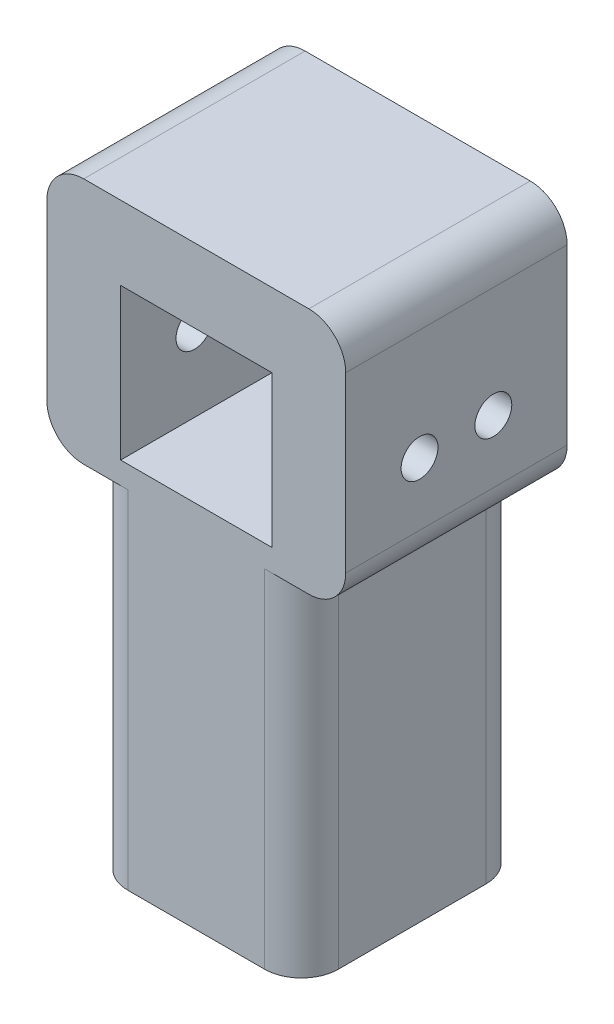
ISO-10303-21;
HEADER;
FILE_DESCRIPTION(('STEP AP214'),'2;1');
FILE_NAME('part.step','',(''),(''),'','','');
FILE_SCHEMA(('AUTOMOTIVE_DESIGN { 1 0 10303 214 1 1 1 1 }'));
ENDSEC;
DATA;
#1=APPLICATION_CONTEXT('core data for automotive mechanical design processes');
#2=APPLICATION_PROTOCOL_DEFINITION('international standard','automotive_design',2000,#1);
#3=PRODUCT_CONTEXT('',#1,'mechanical');
#4=PRODUCT('Part','Part','',(#3));
#5=PRODUCT_RELATED_PRODUCT_CATEGORY('part','',(#4));
#6=PRODUCT_DEFINITION_FORMATION('','',#4);
#7=PRODUCT_DEFINITION_CONTEXT('part definition',#1,'design');
#8=PRODUCT_DEFINITION('design','',#6,#7);
#9=PRODUCT_DEFINITION_SHAPE('','',#8);
#10=(LENGTH_UNIT() NAMED_UNIT(*) SI_UNIT(.MILLI.,.METRE.));
#11=(NAMED_UNIT(*) PLANE_ANGLE_UNIT() SI_UNIT($,.RADIAN.));
#12=(NAMED_UNIT(*) SI_UNIT($,.STERADIAN.) SOLID_ANGLE_UNIT());
#13=UNCERTAINTY_MEASURE_WITH_UNIT(LENGTH_MEASURE(1.E-05),#10,'distance_accuracy_value','');
#14=(GEOMETRIC_REPRESENTATION_CONTEXT(3) GLOBAL_UNCERTAINTY_ASSIGNED_CONTEXT((#13)) GLOBAL_UNIT_ASSIGNED_CONTEXT((#10,
#11,#12)) REPRESENTATION_CONTEXT('',''));
#15=CARTESIAN_POINT('',(0.,0.,0.));
#16=DIRECTION('',(0.,0.,1.));
#17=DIRECTION('',(1.,0.,0.));
#18=AXIS2_PLACEMENT_3D('',#15,#16,#17);
#19=CARTESIAN_POINT('',(20.5,0.,30.));
#20=DIRECTION('',(-1.,0.,0.));
#21=DIRECTION('',(0.,0.,1.));
#22=AXIS2_PLACEMENT_3D('',#19,#20,#21);
#23=PLANE('',#22);
#24=CARTESIAN_POINT('',(20.5,10.5,10.));
#25=DIRECTION('',(-1.,0.,0.));
#26=DIRECTION('',(0.,0.,1.));
#27=AXIS2_PLACEMENT_3D('',#24,#25,#26);
#28=CIRCLE('',#27,2.5);
#29=CARTESIAN_POINT('',(20.5,10.5,12.5));
#30=VERTEX_POINT('',#29);
#31=EDGE_CURVE('E423',#30,#30,#28,.T.);
#32=ORIENTED_EDGE('',*,*,#31,.F.);
#33=EDGE_LOOP('',(#32));
#34=FACE_BOUND('',#33,.T.);
#35=CARTESIAN_POINT('',(20.5,10.5,20.));
#36=DIRECTION('',(-1.,0.,0.));
#37=DIRECTION('',(0.,0.,1.));
#38=AXIS2_PLACEMENT_3D('',#35,#36,#37);
#39=CIRCLE('',#38,2.5);
#40=CARTESIAN_POINT('',(20.5,10.5,22.5));
#41=VERTEX_POINT('',#40);
#42=EDGE_CURVE('E222',#41,#41,#39,.T.);
#43=ORIENTED_EDGE('',*,*,#42,.F.);
#44=EDGE_LOOP('',(#43));
#45=FACE_BOUND('',#44,.T.);
#46=DIRECTION('',(0.,1.,0.));
#47=VECTOR('',#46,1.);
#48=CARTESIAN_POINT('',(20.5,0.,0.));
#49=LINE('',#48,#47);
#50=CARTESIAN_POINT('',(20.5,0.,0.));
#51=VERTEX_POINT('',#50);
#52=CARTESIAN_POINT('',(20.5,20.5,0.));
#53=VERTEX_POINT('',#52);
#54=EDGE_CURVE('E187',#51,#53,#49,.T.);
#55=ORIENTED_EDGE('',*,*,#54,.F.);
#56=DIRECTION('',(0.,0.,-1.));
#57=VECTOR('',#56,1.);
#58=CARTESIAN_POINT('',(20.5,0.,30.));
#59=LINE('',#58,#57);
#60=CARTESIAN_POINT('',(20.5,0.,30.));
#61=VERTEX_POINT('',#60);
#62=EDGE_CURVE('E183',#61,#51,#59,.T.);
#63=ORIENTED_EDGE('',*,*,#62,.F.);
#64=DIRECTION('',(0.,1.,0.));
#65=VECTOR('',#64,1.);
#66=CARTESIAN_POINT('',(20.5,0.,30.));
#67=LINE('',#66,#65);
#68=CARTESIAN_POINT('',(20.5,20.5,30.));
#69=VERTEX_POINT('',#68);
#70=EDGE_CURVE('E185',#61,#69,#67,.T.);
#71=ORIENTED_EDGE('',*,*,#70,.T.);
#72=DIRECTION('',(0.,0.,-1.));
#73=VECTOR('',#72,1.);
#74=CARTESIAN_POINT('',(20.5,20.5,30.));
#75=LINE('',#74,#73);
#76=EDGE_CURVE('E255',#69,#53,#75,.T.);
#77=ORIENTED_EDGE('',*,*,#76,.T.);
#78=EDGE_LOOP('',(#55,#63,#71,#77));
#79=FACE_BOUND('',#78,.T.);
#80=ADVANCED_FACE('F43',(#34,#45,#79),#23,.T.);
#81=CARTESIAN_POINT('',(0.,0.,30.));
#82=DIRECTION('',(0.,1.,0.));
#83=DIRECTION('',(0.,0.,1.));
#84=AXIS2_PLACEMENT_3D('',#81,#82,#83);
#85=PLANE('',#84);
#86=DIRECTION('',(1.,0.,0.));
#87=VECTOR('',#86,1.);
#88=CARTESIAN_POINT('',(0.,0.,0.));
#89=LINE('',#88,#87);
#90=CARTESIAN_POINT('',(0.,0.,0.));
#91=VERTEX_POINT('',#90);
#92=EDGE_CURVE('E243',#91,#51,#89,.T.);
#93=ORIENTED_EDGE('',*,*,#92,.F.);
#94=DIRECTION('',(0.,0.,-1.));
#95=VECTOR('',#94,1.);
#96=CARTESIAN_POINT('',(0.,0.,30.));
#97=LINE('',#96,#95);
#98=CARTESIAN_POINT('',(0.,0.,30.));
#99=VERTEX_POINT('',#98);
#100=EDGE_CURVE('E194',#99,#91,#97,.T.);
#101=ORIENTED_EDGE('',*,*,#100,.F.);
#102=DIRECTION('',(1.,0.,0.));
#103=VECTOR('',#102,1.);
#104=CARTESIAN_POINT('',(0.,0.,30.));
#105=LINE('',#104,#103);
#106=EDGE_CURVE('E200',#99,#61,#105,.T.);
#107=ORIENTED_EDGE('',*,*,#106,.T.);
#108=ORIENTED_EDGE('',*,*,#62,.T.);
#109=EDGE_LOOP('',(#93,#101,#107,#108));
#110=FACE_BOUND('',#109,.T.);
#111=ADVANCED_FACE('F206',(#110),#85,.T.);
#112=CARTESIAN_POINT('',(0.,0.,30.));
#113=DIRECTION('',(-1.,0.,0.));
#114=DIRECTION('',(0.,0.,1.));
#115=AXIS2_PLACEMENT_3D('',#112,#113,#114);
#116=PLANE('',#115);
#117=CARTESIAN_POINT('',(0.,10.5,10.));
#118=DIRECTION('',(-1.,0.,0.));
#119=DIRECTION('',(0.,0.,1.));
#120=AXIS2_PLACEMENT_3D('',#117,#118,#119);
#121=CIRCLE('',#120,2.5);
#122=CARTESIAN_POINT('',(0.,10.5,12.5));
#123=VERTEX_POINT('',#122);
#124=EDGE_CURVE('E430',#123,#123,#121,.T.);
#125=ORIENTED_EDGE('',*,*,#124,.T.);
#126=EDGE_LOOP('',(#125));
#127=FACE_BOUND('',#126,.T.);
#128=CARTESIAN_POINT('',(0.,10.5,20.));
#129=DIRECTION('',(-1.,0.,0.));
#130=DIRECTION('',(0.,0.,1.));
#131=AXIS2_PLACEMENT_3D('',#128,#129,#130);
#132=CIRCLE('',#131,2.5);
#133=CARTESIAN_POINT('',(0.,10.5,22.5));
#134=VERTEX_POINT('',#133);
#135=EDGE_CURVE('E414',#134,#134,#132,.T.);
#136=ORIENTED_EDGE('',*,*,#135,.T.);
#137=EDGE_LOOP('',(#136));
#138=FACE_BOUND('',#137,.T.);
#139=DIRECTION('',(0.,1.,0.));
#140=VECTOR('',#139,1.);
#141=CARTESIAN_POINT('',(0.,0.,0.));
#142=LINE('',#141,#140);
#143=CARTESIAN_POINT('',(0.,20.5,0.));
#144=VERTEX_POINT('',#143);
#145=EDGE_CURVE('E246',#91,#144,#142,.T.);
#146=ORIENTED_EDGE('',*,*,#145,.T.);
#147=DIRECTION('',(0.,0.,-1.));
#148=VECTOR('',#147,1.);
#149=CARTESIAN_POINT('',(0.,20.5,30.));
#150=LINE('',#149,#148);
#151=CARTESIAN_POINT('',(0.,20.5,30.));
#152=VERTEX_POINT('',#151);
#153=EDGE_CURVE('E258',#152,#144,#150,.T.);
#154=ORIENTED_EDGE('',*,*,#153,.F.);
#155=DIRECTION('',(0.,1.,0.));
#156=VECTOR('',#155,1.);
#157=CARTESIAN_POINT('',(0.,0.,30.));
#158=LINE('',#157,#156);
#159=EDGE_CURVE('E209',#99,#152,#158,.T.);
#160=ORIENTED_EDGE('',*,*,#159,.F.);
#161=ORIENTED_EDGE('',*,*,#100,.T.);
#162=EDGE_LOOP('',(#146,#154,#160,#161));
#163=FACE_BOUND('',#162,.T.);
#164=ADVANCED_FACE('F452',(#127,#138,#163),#116,.F.);
#165=CARTESIAN_POINT('',(24.5,0.,30.));
#166=DIRECTION('',(-1.,0.,0.));
#167=DIRECTION('',(0.,0.,1.));
#168=AXIS2_PLACEMENT_3D('',#165,#166,#167);
#169=PLANE('',#168);
#170=DIRECTION('',(0.,0.,-1.));
#171=VECTOR('',#170,1.);
#172=CARTESIAN_POINT('',(24.5,-3.,30.));
#173=LINE('',#172,#171);
#174=CARTESIAN_POINT('',(24.5,-3.,25.));
#175=VERTEX_POINT('',#174);
#176=CARTESIAN_POINT('',(24.5,-3.,5.));
#177=VERTEX_POINT('',#176);
#178=EDGE_CURVE('E259',#175,#177,#173,.T.);
#179=ORIENTED_EDGE('',*,*,#178,.F.);
#180=DIRECTION('',(0.,1.,0.));
#181=VECTOR('',#180,1.);
#182=CARTESIAN_POINT('',(24.5,-50.,25.));
#183=LINE('',#182,#181);
#184=CARTESIAN_POINT('',(24.5,-50.,25.));
#185=VERTEX_POINT('',#184);
#186=EDGE_CURVE('E308',#175,#185,#183,.F.);
#187=ORIENTED_EDGE('',*,*,#186,.T.);
#188=DIRECTION('',(0.,0.,-1.));
#189=VECTOR('',#188,1.);
#190=CARTESIAN_POINT('',(24.5,-50.,30.));
#191=LINE('',#190,#189);
#192=CARTESIAN_POINT('',(24.5,-50.,5.));
#193=VERTEX_POINT('',#192);
#194=EDGE_CURVE('E217',#185,#193,#191,.T.);
#195=ORIENTED_EDGE('',*,*,#194,.T.);
#196=DIRECTION('',(0.,1.,0.));
#197=VECTOR('',#196,1.);
#198=CARTESIAN_POINT('',(24.5,0.,5.));
#199=LINE('',#198,#197);
#200=EDGE_CURVE('E304',#193,#177,#199,.T.);
#201=ORIENTED_EDGE('',*,*,#200,.T.);
#202=EDGE_LOOP('',(#179,#187,#195,#201));
#203=FACE_BOUND('',#202,.T.);
#204=ADVANCED_FACE('F455',(#203),#169,.F.);
#205=CARTESIAN_POINT('',(0.,-3.,30.));
#206=DIRECTION('',(0.,-1.,0.));
#207=DIRECTION('',(1.,0.,0.));
#208=AXIS2_PLACEMENT_3D('',#205,#206,#207);
#209=PLANE('',#208);
#210=DIRECTION('',(-1.,0.,0.));
#211=VECTOR('',#210,1.);
#212=CARTESIAN_POINT('',(0.,-3.,0.));
#213=LINE('',#212,#211);
#214=CARTESIAN_POINT('',(25.5,-3.,0.));
#215=VERTEX_POINT('',#214);
#216=CARTESIAN_POINT('',(19.5,-3.,0.));
#217=VERTEX_POINT('',#216);
#218=EDGE_CURVE('E218',#215,#217,#213,.T.);
#219=ORIENTED_EDGE('',*,*,#218,.F.);
#220=DIRECTION('',(0.,0.,-1.));
#221=VECTOR('',#220,1.);
#222=CARTESIAN_POINT('',(25.5,-3.,30.));
#223=LINE('',#222,#221);
#224=CARTESIAN_POINT('',(25.5,-3.,30.));
#225=VERTEX_POINT('',#224);
#226=EDGE_CURVE('E351',#215,#225,#223,.F.);
#227=ORIENTED_EDGE('',*,*,#226,.T.);
#228=DIRECTION('',(-1.,0.,0.));
#229=VECTOR('',#228,1.);
#230=CARTESIAN_POINT('',(0.,-3.,30.));
#231=LINE('',#230,#229);
#232=CARTESIAN_POINT('',(19.5,-3.,30.));
#233=VERTEX_POINT('',#232);
#234=EDGE_CURVE('E254',#225,#233,#231,.T.);
#235=ORIENTED_EDGE('',*,*,#234,.T.);
#236=CARTESIAN_POINT('',(19.5,-3.,25.));
#237=DIRECTION('',(0.,-1.,0.));
#238=DIRECTION('',(1.,0.,0.));
#239=AXIS2_PLACEMENT_3D('',#236,#237,#238);
#240=CIRCLE('',#239,5.);
#241=EDGE_CURVE('E322',#233,#175,#240,.F.);
#242=ORIENTED_EDGE('',*,*,#241,.T.);
#243=ORIENTED_EDGE('',*,*,#178,.T.);
#244=CARTESIAN_POINT('',(19.5,-3.,5.));
#245=DIRECTION('',(0.,-1.,0.));
#246=DIRECTION('',(1.,0.,0.));
#247=AXIS2_PLACEMENT_3D('',#244,#245,#246);
#248=CIRCLE('',#247,5.);
#249=EDGE_CURVE('E328',#177,#217,#248,.F.);
#250=ORIENTED_EDGE('',*,*,#249,.T.);
#251=EDGE_LOOP('',(#219,#227,#235,#242,#243,#250));
#252=FACE_BOUND('',#251,.T.);
#253=ADVANCED_FACE('F499',(#252),#209,.T.);
#254=CARTESIAN_POINT('',(30.5,0.,30.));
#255=DIRECTION('',(1.,0.,0.));
#256=DIRECTION('',(0.,0.,-1.));
#257=AXIS2_PLACEMENT_3D('',#254,#255,#256);
#258=PLANE('',#257);
#259=CARTESIAN_POINT('',(30.5,10.5,10.));
#260=DIRECTION('',(1.,0.,0.));
#261=DIRECTION('',(0.,0.,-1.));
#262=AXIS2_PLACEMENT_3D('',#259,#260,#261);
#263=CIRCLE('',#262,2.5);
#264=CARTESIAN_POINT('',(30.5,10.5,7.5));
#265=VERTEX_POINT('',#264);
#266=EDGE_CURVE('E435',#265,#265,#263,.T.);
#267=ORIENTED_EDGE('',*,*,#266,.F.);
#268=EDGE_LOOP('',(#267));
#269=FACE_BOUND('',#268,.T.);
#270=CARTESIAN_POINT('',(30.5,10.5,20.));
#271=DIRECTION('',(1.,0.,0.));
#272=DIRECTION('',(0.,0.,-1.));
#273=AXIS2_PLACEMENT_3D('',#270,#271,#272);
#274=CIRCLE('',#273,2.5);
#275=CARTESIAN_POINT('',(30.5,10.5,17.5));
#276=VERTEX_POINT('',#275);
#277=EDGE_CURVE('E419',#276,#276,#274,.T.);
#278=ORIENTED_EDGE('',*,*,#277,.F.);
#279=EDGE_LOOP('',(#278));
#280=FACE_BOUND('',#279,.T.);
#281=DIRECTION('',(0.,-1.,0.));
#282=VECTOR('',#281,1.);
#283=CARTESIAN_POINT('',(30.5,0.,30.));
#284=LINE('',#283,#282);
#285=CARTESIAN_POINT('',(30.5,25.5,30.));
#286=VERTEX_POINT('',#285);
#287=CARTESIAN_POINT('',(30.5,2.,30.));
#288=VERTEX_POINT('',#287);
#289=EDGE_CURVE('E405',#286,#288,#284,.T.);
#290=ORIENTED_EDGE('',*,*,#289,.T.);
#291=DIRECTION('',(0.,0.,-1.));
#292=VECTOR('',#291,1.);
#293=CARTESIAN_POINT('',(30.5,2.,30.));
#294=LINE('',#293,#292);
#295=CARTESIAN_POINT('',(30.5,2.,0.));
#296=VERTEX_POINT('',#295);
#297=EDGE_CURVE('E335',#288,#296,#294,.T.);
#298=ORIENTED_EDGE('',*,*,#297,.T.);
#299=DIRECTION('',(0.,-1.,0.));
#300=VECTOR('',#299,1.);
#301=CARTESIAN_POINT('',(30.5,0.,0.));
#302=LINE('',#301,#300);
#303=CARTESIAN_POINT('',(30.5,25.5,0.));
#304=VERTEX_POINT('',#303);
#305=EDGE_CURVE('E221',#304,#296,#302,.T.);
#306=ORIENTED_EDGE('',*,*,#305,.F.);
#307=DIRECTION('',(0.,0.,-1.));
#308=VECTOR('',#307,1.);
#309=CARTESIAN_POINT('',(30.5,25.5,30.));
#310=LINE('',#309,#308);
#311=EDGE_CURVE('E332',#304,#286,#310,.F.);
#312=ORIENTED_EDGE('',*,*,#311,.T.);
#313=EDGE_LOOP('',(#290,#298,#306,#312));
#314=FACE_BOUND('',#313,.T.);
#315=ADVANCED_FACE('F495',(#269,#280,#314),#258,.T.);
#316=CARTESIAN_POINT('',(0.,30.5,30.));
#317=DIRECTION('',(0.,1.,0.));
#318=DIRECTION('',(0.,0.,1.));
#319=AXIS2_PLACEMENT_3D('',#316,#317,#318);
#320=PLANE('',#319);
#321=DIRECTION('',(1.,0.,0.));
#322=VECTOR('',#321,1.);
#323=CARTESIAN_POINT('',(0.,30.5,30.));
#324=LINE('',#323,#322);
#325=CARTESIAN_POINT('',(-5.,30.5,30.));
#326=VERTEX_POINT('',#325);
#327=CARTESIAN_POINT('',(25.5,30.5,30.));
#328=VERTEX_POINT('',#327);
#329=EDGE_CURVE('E399',#326,#328,#324,.T.);
#330=ORIENTED_EDGE('',*,*,#329,.T.);
#331=DIRECTION('',(0.,0.,-1.));
#332=VECTOR('',#331,1.);
#333=CARTESIAN_POINT('',(25.5,30.5,30.));
#334=LINE('',#333,#332);
#335=CARTESIAN_POINT('',(25.5,30.5,0.));
#336=VERTEX_POINT('',#335);
#337=EDGE_CURVE('E368',#328,#336,#334,.T.);
#338=ORIENTED_EDGE('',*,*,#337,.T.);
#339=DIRECTION('',(1.,0.,0.));
#340=VECTOR('',#339,1.);
#341=CARTESIAN_POINT('',(0.,30.5,0.));
#342=LINE('',#341,#340);
#343=CARTESIAN_POINT('',(-5.,30.5,0.));
#344=VERTEX_POINT('',#343);
#345=EDGE_CURVE('E226',#344,#336,#342,.T.);
#346=ORIENTED_EDGE('',*,*,#345,.F.);
#347=DIRECTION('',(0.,0.,-1.));
#348=VECTOR('',#347,1.);
#349=CARTESIAN_POINT('',(-5.,30.5,30.));
#350=LINE('',#349,#348);
#351=EDGE_CURVE('E365',#344,#326,#350,.F.);
#352=ORIENTED_EDGE('',*,*,#351,.T.);
#353=EDGE_LOOP('',(#330,#338,#346,#352));
#354=FACE_BOUND('',#353,.T.);
#355=ADVANCED_FACE('F492',(#354),#320,.T.);
#356=CARTESIAN_POINT('',(-10.,0.,30.));
#357=DIRECTION('',(-1.,0.,0.));
#358=DIRECTION('',(0.,0.,1.));
#359=AXIS2_PLACEMENT_3D('',#356,#357,#358);
#360=PLANE('',#359);
#361=DIRECTION('',(0.,1.,0.));
#362=VECTOR('',#361,1.);
#363=CARTESIAN_POINT('',(-10.,0.,30.));
#364=LINE('',#363,#362);
#365=CARTESIAN_POINT('',(-10.,2.,30.));
#366=VERTEX_POINT('',#365);
#367=CARTESIAN_POINT('',(-10.,25.5,30.));
#368=VERTEX_POINT('',#367);
#369=EDGE_CURVE('E377',#366,#368,#364,.T.);
#370=ORIENTED_EDGE('',*,*,#369,.T.);
#371=DIRECTION('',(0.,0.,-1.));
#372=VECTOR('',#371,1.);
#373=CARTESIAN_POINT('',(-10.,25.5,30.));
#374=LINE('',#373,#372);
#375=CARTESIAN_POINT('',(-10.,25.5,0.));
#376=VERTEX_POINT('',#375);
#377=EDGE_CURVE('E52',#368,#376,#374,.T.);
#378=ORIENTED_EDGE('',*,*,#377,.T.);
#379=DIRECTION('',(0.,1.,0.));
#380=VECTOR('',#379,1.);
#381=CARTESIAN_POINT('',(-10.,0.,0.));
#382=LINE('',#381,#380);
#383=CARTESIAN_POINT('',(-10.,2.,0.));
#384=VERTEX_POINT('',#383);
#385=EDGE_CURVE('E230',#384,#376,#382,.T.);
#386=ORIENTED_EDGE('',*,*,#385,.F.);
#387=DIRECTION('',(0.,0.,-1.));
#388=VECTOR('',#387,1.);
#389=CARTESIAN_POINT('',(-10.,2.,30.));
#390=LINE('',#389,#388);
#391=EDGE_CURVE('E66',#384,#366,#390,.F.);
#392=ORIENTED_EDGE('',*,*,#391,.T.);
#393=EDGE_LOOP('',(#370,#378,#386,#392));
#394=FACE_BOUND('',#393,.T.);
#395=ADVANCED_FACE('F376',(#394),#360,.T.);
#396=CARTESIAN_POINT('',(0.,-3.,30.));
#397=DIRECTION('',(0.,1.,0.));
#398=DIRECTION('',(0.,0.,1.));
#399=AXIS2_PLACEMENT_3D('',#396,#397,#398);
#400=PLANE('',#399);
#401=DIRECTION('',(1.,0.,0.));
#402=VECTOR('',#401,1.);
#403=CARTESIAN_POINT('',(0.,-3.,30.));
#404=LINE('',#403,#402);
#405=CARTESIAN_POINT('',(-5.,-3.,30.));
#406=VERTEX_POINT('',#405);
#407=CARTESIAN_POINT('',(1.,-3.,30.));
#408=VERTEX_POINT('',#407);
#409=EDGE_CURVE('E391',#406,#408,#404,.T.);
#410=ORIENTED_EDGE('',*,*,#409,.F.);
#411=DIRECTION('',(0.,0.,-1.));
#412=VECTOR('',#411,1.);
#413=CARTESIAN_POINT('',(-5.,-3.,0.));
#414=LINE('',#413,#412);
#415=CARTESIAN_POINT('',(-5.,-3.,0.));
#416=VERTEX_POINT('',#415);
#417=EDGE_CURVE('E11',#406,#416,#414,.T.);
#418=ORIENTED_EDGE('',*,*,#417,.T.);
#419=DIRECTION('',(1.,0.,0.));
#420=VECTOR('',#419,1.);
#421=CARTESIAN_POINT('',(0.,-3.,0.));
#422=LINE('',#421,#420);
#423=CARTESIAN_POINT('',(1.,-3.,0.));
#424=VERTEX_POINT('',#423);
#425=EDGE_CURVE('E234',#416,#424,#422,.T.);
#426=ORIENTED_EDGE('',*,*,#425,.T.);
#427=CARTESIAN_POINT('',(1.,-3.,5.));
#428=DIRECTION('',(0.,1.,0.));
#429=DIRECTION('',(0.,0.,1.));
#430=AXIS2_PLACEMENT_3D('',#427,#428,#429);
#431=CIRCLE('',#430,5.);
#432=CARTESIAN_POINT('',(-4.,-3.,5.));
#433=VERTEX_POINT('',#432);
#434=EDGE_CURVE('E325',#424,#433,#431,.T.);
#435=ORIENTED_EDGE('',*,*,#434,.T.);
#436=DIRECTION('',(0.,0.,-1.));
#437=VECTOR('',#436,1.);
#438=CARTESIAN_POINT('',(-4.,-3.,30.));
#439=LINE('',#438,#437);
#440=CARTESIAN_POINT('',(-4.,-3.,25.));
#441=VERTEX_POINT('',#440);
#442=EDGE_CURVE('E272',#441,#433,#439,.T.);
#443=ORIENTED_EDGE('',*,*,#442,.F.);
#444=CARTESIAN_POINT('',(1.,-3.,25.));
#445=DIRECTION('',(0.,1.,0.));
#446=DIRECTION('',(0.,0.,1.));
#447=AXIS2_PLACEMENT_3D('',#444,#445,#446);
#448=CIRCLE('',#447,5.);
#449=EDGE_CURVE('E318',#441,#408,#448,.T.);
#450=ORIENTED_EDGE('',*,*,#449,.T.);
#451=EDGE_LOOP('',(#410,#418,#426,#435,#443,#450));
#452=FACE_BOUND('',#451,.T.);
#453=ADVANCED_FACE('F389',(#452),#400,.F.);
#454=CARTESIAN_POINT('',(-4.,0.,30.));
#455=DIRECTION('',(-1.,0.,0.));
#456=DIRECTION('',(0.,0.,1.));
#457=AXIS2_PLACEMENT_3D('',#454,#455,#456);
#458=PLANE('',#457);
#459=DIRECTION('',(0.,0.,-1.));
#460=VECTOR('',#459,1.);
#461=CARTESIAN_POINT('',(-4.,-50.,30.));
#462=LINE('',#461,#460);
#463=CARTESIAN_POINT('',(-4.,-50.,25.));
#464=VERTEX_POINT('',#463);
#465=CARTESIAN_POINT('',(-4.,-50.,5.));
#466=VERTEX_POINT('',#465);
#467=EDGE_CURVE('E268',#464,#466,#462,.T.);
#468=ORIENTED_EDGE('',*,*,#467,.F.);
#469=DIRECTION('',(0.,1.,0.));
#470=VECTOR('',#469,1.);
#471=CARTESIAN_POINT('',(-4.,0.,25.));
#472=LINE('',#471,#470);
#473=EDGE_CURVE('E281',#464,#441,#472,.T.);
#474=ORIENTED_EDGE('',*,*,#473,.T.);
#475=ORIENTED_EDGE('',*,*,#442,.T.);
#476=DIRECTION('',(0.,1.,0.));
#477=VECTOR('',#476,1.);
#478=CARTESIAN_POINT('',(-4.,-50.,5.));
#479=LINE('',#478,#477);
#480=EDGE_CURVE('E193',#433,#466,#479,.F.);
#481=ORIENTED_EDGE('',*,*,#480,.T.);
#482=EDGE_LOOP('',(#468,#474,#475,#481));
#483=FACE_BOUND('',#482,.T.);
#484=ADVANCED_FACE('F471',(#483),#458,.T.);
#485=CARTESIAN_POINT('',(0.,-50.,30.));
#486=DIRECTION('',(0.,1.,0.));
#487=DIRECTION('',(0.,0.,1.));
#488=AXIS2_PLACEMENT_3D('',#485,#486,#487);
#489=PLANE('',#488);
#490=DIRECTION('',(1.,0.,0.));
#491=VECTOR('',#490,1.);
#492=CARTESIAN_POINT('',(0.,-50.,30.));
#493=LINE('',#492,#491);
#494=CARTESIAN_POINT('',(1.,-50.,30.));
#495=VERTEX_POINT('',#494);
#496=CARTESIAN_POINT('',(19.5,-50.,30.));
#497=VERTEX_POINT('',#496);
#498=EDGE_CURVE('E204',#495,#497,#493,.T.);
#499=ORIENTED_EDGE('',*,*,#498,.F.);
#500=CARTESIAN_POINT('',(1.,-50.,25.));
#501=DIRECTION('',(0.,1.,0.));
#502=DIRECTION('',(0.,0.,1.));
#503=AXIS2_PLACEMENT_3D('',#500,#501,#502);
#504=CIRCLE('',#503,5.);
#505=EDGE_CURVE('E301',#495,#464,#504,.F.);
#506=ORIENTED_EDGE('',*,*,#505,.T.);
#507=ORIENTED_EDGE('',*,*,#467,.T.);
#508=CARTESIAN_POINT('',(1.,-50.,5.));
#509=DIRECTION('',(0.,1.,0.));
#510=DIRECTION('',(0.,0.,1.));
#511=AXIS2_PLACEMENT_3D('',#508,#509,#510);
#512=CIRCLE('',#511,5.);
#513=CARTESIAN_POINT('',(1.,-50.,0.));
#514=VERTEX_POINT('',#513);
#515=EDGE_CURVE('E295',#466,#514,#512,.F.);
#516=ORIENTED_EDGE('',*,*,#515,.T.);
#517=DIRECTION('',(1.,0.,0.));
#518=VECTOR('',#517,1.);
#519=CARTESIAN_POINT('',(0.,-50.,0.));
#520=LINE('',#519,#518);
#521=CARTESIAN_POINT('',(19.5,-50.,0.));
#522=VERTEX_POINT('',#521);
#523=EDGE_CURVE('E237',#514,#522,#520,.T.);
#524=ORIENTED_EDGE('',*,*,#523,.T.);
#525=CARTESIAN_POINT('',(19.5,-50.,5.));
#526=DIRECTION('',(0.,1.,0.));
#527=DIRECTION('',(0.,0.,1.));
#528=AXIS2_PLACEMENT_3D('',#525,#526,#527);
#529=CIRCLE('',#528,5.);
#530=EDGE_CURVE('E292',#522,#193,#529,.F.);
#531=ORIENTED_EDGE('',*,*,#530,.T.);
#532=ORIENTED_EDGE('',*,*,#194,.F.);
#533=CARTESIAN_POINT('',(19.5,-50.,25.));
#534=DIRECTION('',(0.,1.,0.));
#535=DIRECTION('',(0.,0.,1.));
#536=AXIS2_PLACEMENT_3D('',#533,#534,#535);
#537=CIRCLE('',#536,5.);
#538=EDGE_CURVE('E298',#185,#497,#537,.F.);
#539=ORIENTED_EDGE('',*,*,#538,.T.);
#540=EDGE_LOOP('',(#499,#506,#507,#516,#524,#531,#532,#539));
#541=FACE_BOUND('',#540,.T.);
#542=ADVANCED_FACE('F464',(#541),#489,.F.);
#543=CARTESIAN_POINT('',(0.,20.5,30.));
#544=DIRECTION('',(0.,1.,0.));
#545=DIRECTION('',(0.,0.,1.));
#546=AXIS2_PLACEMENT_3D('',#543,#544,#545);
#547=PLANE('',#546);
#548=DIRECTION('',(1.,0.,0.));
#549=VECTOR('',#548,1.);
#550=CARTESIAN_POINT('',(0.,20.5,0.));
#551=LINE('',#550,#549);
#552=EDGE_CURVE('E250',#144,#53,#551,.T.);
#553=ORIENTED_EDGE('',*,*,#552,.T.);
#554=ORIENTED_EDGE('',*,*,#76,.F.);
#555=DIRECTION('',(1.,0.,0.));
#556=VECTOR('',#555,1.);
#557=CARTESIAN_POINT('',(0.,20.5,30.));
#558=LINE('',#557,#556);
#559=EDGE_CURVE('E201',#152,#69,#558,.T.);
#560=ORIENTED_EDGE('',*,*,#559,.F.);
#561=ORIENTED_EDGE('',*,*,#153,.T.);
#562=EDGE_LOOP('',(#553,#554,#560,#561));
#563=FACE_BOUND('',#562,.T.);
#564=ADVANCED_FACE('F462',(#563),#547,.F.);
#565=CARTESIAN_POINT('',(0.,0.,30.));
#566=DIRECTION('',(0.,0.,1.));
#567=DIRECTION('',(1.,0.,0.));
#568=AXIS2_PLACEMENT_3D('',#565,#566,#567);
#569=PLANE('',#568);
#570=ORIENTED_EDGE('',*,*,#234,.F.);
#571=CARTESIAN_POINT('',(25.5,2.,30.));
#572=DIRECTION('',(0.,0.,1.));
#573=DIRECTION('',(1.,0.,0.));
#574=AXIS2_PLACEMENT_3D('',#571,#572,#573);
#575=CIRCLE('',#574,5.);
#576=EDGE_CURVE('E362',#225,#288,#575,.T.);
#577=ORIENTED_EDGE('',*,*,#576,.T.);
#578=ORIENTED_EDGE('',*,*,#289,.F.);
#579=CARTESIAN_POINT('',(25.5,25.5,30.));
#580=DIRECTION('',(0.,0.,1.));
#581=DIRECTION('',(1.,0.,0.));
#582=AXIS2_PLACEMENT_3D('',#579,#580,#581);
#583=CIRCLE('',#582,5.);
#584=EDGE_CURVE('E359',#286,#328,#583,.T.);
#585=ORIENTED_EDGE('',*,*,#584,.T.);
#586=ORIENTED_EDGE('',*,*,#329,.F.);
#587=CARTESIAN_POINT('',(-5.,25.5,30.));
#588=DIRECTION('',(0.,0.,1.));
#589=DIRECTION('',(1.,0.,0.));
#590=AXIS2_PLACEMENT_3D('',#587,#588,#589);
#591=CIRCLE('',#590,5.);
#592=EDGE_CURVE('E59',#326,#368,#591,.T.);
#593=ORIENTED_EDGE('',*,*,#592,.T.);
#594=ORIENTED_EDGE('',*,*,#369,.F.);
#595=CARTESIAN_POINT('',(-5.,2.,30.));
#596=DIRECTION('',(0.,0.,1.));
#597=DIRECTION('',(1.,0.,0.));
#598=AXIS2_PLACEMENT_3D('',#595,#596,#597);
#599=CIRCLE('',#598,5.);
#600=EDGE_CURVE('E354',#366,#406,#599,.T.);
#601=ORIENTED_EDGE('',*,*,#600,.T.);
#602=ORIENTED_EDGE('',*,*,#409,.T.);
#603=DIRECTION('',(0.,1.,0.));
#604=VECTOR('',#603,1.);
#605=CARTESIAN_POINT('',(1.,0.,30.));
#606=LINE('',#605,#604);
#607=EDGE_CURVE('E289',#408,#495,#606,.F.);
#608=ORIENTED_EDGE('',*,*,#607,.T.);
#609=ORIENTED_EDGE('',*,*,#498,.T.);
#610=DIRECTION('',(0.,1.,0.));
#611=VECTOR('',#610,1.);
#612=CARTESIAN_POINT('',(19.5,-3.,30.));
#613=LINE('',#612,#611);
#614=EDGE_CURVE('E285',#497,#233,#613,.T.);
#615=ORIENTED_EDGE('',*,*,#614,.T.);
#616=EDGE_LOOP('',(#570,#577,#578,#585,#586,#593,#594,#601,#602,#608,#609,#615));
#617=FACE_BOUND('',#616,.T.);
#618=ORIENTED_EDGE('',*,*,#70,.F.);
#619=ORIENTED_EDGE('',*,*,#106,.F.);
#620=ORIENTED_EDGE('',*,*,#159,.T.);
#621=ORIENTED_EDGE('',*,*,#559,.T.);
#622=EDGE_LOOP('',(#618,#619,#620,#621));
#623=FACE_BOUND('',#622,.T.);
#624=ADVANCED_FACE('F198',(#617,#623),#569,.T.);
#625=CARTESIAN_POINT('',(0.,0.,0.));
#626=DIRECTION('',(0.,0.,1.));
#627=DIRECTION('',(1.,0.,0.));
#628=AXIS2_PLACEMENT_3D('',#625,#626,#627);
#629=PLANE('',#628);
#630=ORIENTED_EDGE('',*,*,#305,.T.);
#631=CARTESIAN_POINT('',(25.5,2.,0.));
#632=DIRECTION('',(0.,0.,1.));
#633=DIRECTION('',(1.,0.,0.));
#634=AXIS2_PLACEMENT_3D('',#631,#632,#633);
#635=CIRCLE('',#634,5.);
#636=EDGE_CURVE('E348',#296,#215,#635,.F.);
#637=ORIENTED_EDGE('',*,*,#636,.T.);
#638=ORIENTED_EDGE('',*,*,#218,.T.);
#639=DIRECTION('',(0.,1.,0.));
#640=VECTOR('',#639,1.);
#641=CARTESIAN_POINT('',(19.5,0.,0.));
#642=LINE('',#641,#640);
#643=EDGE_CURVE('E311',#217,#522,#642,.F.);
#644=ORIENTED_EDGE('',*,*,#643,.T.);
#645=ORIENTED_EDGE('',*,*,#523,.F.);
#646=DIRECTION('',(0.,1.,0.));
#647=VECTOR('',#646,1.);
#648=CARTESIAN_POINT('',(1.,-3.,0.));
#649=LINE('',#648,#647);
#650=EDGE_CURVE('E314',#514,#424,#649,.T.);
#651=ORIENTED_EDGE('',*,*,#650,.T.);
#652=ORIENTED_EDGE('',*,*,#425,.F.);
#653=CARTESIAN_POINT('',(-5.,2.,0.));
#654=DIRECTION('',(0.,0.,1.));
#655=DIRECTION('',(1.,0.,0.));
#656=AXIS2_PLACEMENT_3D('',#653,#654,#655);
#657=CIRCLE('',#656,5.);
#658=EDGE_CURVE('E339',#416,#384,#657,.F.);
#659=ORIENTED_EDGE('',*,*,#658,.T.);
#660=ORIENTED_EDGE('',*,*,#385,.T.);
#661=CARTESIAN_POINT('',(-5.,25.5,0.));
#662=DIRECTION('',(0.,0.,1.));
#663=DIRECTION('',(1.,0.,0.));
#664=AXIS2_PLACEMENT_3D('',#661,#662,#663);
#665=CIRCLE('',#664,5.);
#666=EDGE_CURVE('E342',#376,#344,#665,.F.);
#667=ORIENTED_EDGE('',*,*,#666,.T.);
#668=ORIENTED_EDGE('',*,*,#345,.T.);
#669=CARTESIAN_POINT('',(25.5,25.5,0.));
#670=DIRECTION('',(0.,0.,1.));
#671=DIRECTION('',(1.,0.,0.));
#672=AXIS2_PLACEMENT_3D('',#669,#670,#671);
#673=CIRCLE('',#672,5.);
#674=EDGE_CURVE('E345',#336,#304,#673,.F.);
#675=ORIENTED_EDGE('',*,*,#674,.T.);
#676=EDGE_LOOP('',(#630,#637,#638,#644,#645,#651,#652,#659,#660,#667,#668,#675));
#677=FACE_BOUND('',#676,.T.);
#678=ORIENTED_EDGE('',*,*,#54,.T.);
#679=ORIENTED_EDGE('',*,*,#552,.F.);
#680=ORIENTED_EDGE('',*,*,#145,.F.);
#681=ORIENTED_EDGE('',*,*,#92,.T.);
#682=EDGE_LOOP('',(#678,#679,#680,#681));
#683=FACE_BOUND('',#682,.T.);
#684=ADVANCED_FACE('F380',(#677,#683),#629,.F.);
#685=CARTESIAN_POINT('',(-9.5,10.5,20.));
#686=DIRECTION('',(1.,0.,0.));
#687=DIRECTION('',(0.,0.,-1.));
#688=AXIS2_PLACEMENT_3D('',#685,#686,#687);
#689=CYLINDRICAL_SURFACE('',#688,2.5);
#690=ORIENTED_EDGE('',*,*,#42,.T.);
#691=EDGE_LOOP('',(#690));
#692=FACE_BOUND('',#691,.T.);
#693=ORIENTED_EDGE('',*,*,#277,.T.);
#694=EDGE_LOOP('',(#693));
#695=FACE_BOUND('',#694,.T.);
#696=ADVANCED_FACE('F592',(#692,#695),#689,.F.);
#697=CARTESIAN_POINT('',(-9.5,10.5,20.));
#698=DIRECTION('',(1.,0.,0.));
#699=DIRECTION('',(0.,0.,-1.));
#700=AXIS2_PLACEMENT_3D('',#697,#698,#699);
#701=CIRCLE('',#700,2.5);
#702=CARTESIAN_POINT('',(-9.5,10.5,17.5));
#703=VERTEX_POINT('',#702);
#704=EDGE_CURVE('E418',#703,#703,#701,.T.);
#705=ORIENTED_EDGE('',*,*,#704,.F.);
#706=EDGE_LOOP('',(#705));
#707=FACE_BOUND('',#706,.T.);
#708=ORIENTED_EDGE('',*,*,#135,.F.);
#709=EDGE_LOOP('',(#708));
#710=FACE_BOUND('',#709,.T.);
#711=ADVANCED_FACE('F718',(#707,#710),#689,.F.);
#712=CARTESIAN_POINT('',(-9.5,10.5,20.));
#713=DIRECTION('',(1.,0.,0.));
#714=DIRECTION('',(0.,0.,-1.));
#715=AXIS2_PLACEMENT_3D('',#712,#713,#714);
#716=PLANE('',#715);
#717=ORIENTED_EDGE('',*,*,#704,.T.);
#718=EDGE_LOOP('',(#717));
#719=FACE_BOUND('',#718,.T.);
#720=ADVANCED_FACE('F699',(#719),#716,.T.);
#721=CARTESIAN_POINT('',(-9.5,10.5,10.));
#722=DIRECTION('',(1.,0.,0.));
#723=DIRECTION('',(0.,0.,-1.));
#724=AXIS2_PLACEMENT_3D('',#721,#722,#723);
#725=CYLINDRICAL_SURFACE('',#724,2.5);
#726=ORIENTED_EDGE('',*,*,#31,.T.);
#727=EDGE_LOOP('',(#726));
#728=FACE_BOUND('',#727,.T.);
#729=ORIENTED_EDGE('',*,*,#266,.T.);
#730=EDGE_LOOP('',(#729));
#731=FACE_BOUND('',#730,.T.);
#732=ADVANCED_FACE('F448',(#728,#731),#725,.F.);
#733=CARTESIAN_POINT('',(-9.5,10.5,10.));
#734=DIRECTION('',(1.,0.,0.));
#735=DIRECTION('',(0.,0.,-1.));
#736=AXIS2_PLACEMENT_3D('',#733,#734,#735);
#737=CIRCLE('',#736,2.5);
#738=CARTESIAN_POINT('',(-9.5,10.5,7.5));
#739=VERTEX_POINT('',#738);
#740=EDGE_CURVE('E434',#739,#739,#737,.T.);
#741=ORIENTED_EDGE('',*,*,#740,.F.);
#742=EDGE_LOOP('',(#741));
#743=FACE_BOUND('',#742,.T.);
#744=ORIENTED_EDGE('',*,*,#124,.F.);
#745=EDGE_LOOP('',(#744));
#746=FACE_BOUND('',#745,.T.);
#747=ADVANCED_FACE('F445',(#743,#746),#725,.F.);
#748=CARTESIAN_POINT('',(-9.5,10.5,10.));
#749=DIRECTION('',(1.,0.,0.));
#750=DIRECTION('',(0.,0.,-1.));
#751=AXIS2_PLACEMENT_3D('',#748,#749,#750);
#752=PLANE('',#751);
#753=ORIENTED_EDGE('',*,*,#740,.T.);
#754=EDGE_LOOP('',(#753));
#755=FACE_BOUND('',#754,.T.);
#756=ADVANCED_FACE('F443',(#755),#752,.T.);
#757=CARTESIAN_POINT('',(1.,0.,25.));
#758=DIRECTION('',(0.,1.,0.));
#759=DIRECTION('',(0.,0.,1.));
#760=AXIS2_PLACEMENT_3D('',#757,#758,#759);
#761=CYLINDRICAL_SURFACE('',#760,5.);
#762=ORIENTED_EDGE('',*,*,#505,.F.);
#763=ORIENTED_EDGE('',*,*,#607,.F.);
#764=ORIENTED_EDGE('',*,*,#449,.F.);
#765=ORIENTED_EDGE('',*,*,#473,.F.);
#766=EDGE_LOOP('',(#762,#763,#764,#765));
#767=FACE_BOUND('',#766,.T.);
#768=ADVANCED_FACE('F507',(#767),#761,.T.);
#769=CARTESIAN_POINT('',(19.5,0.,25.));
#770=DIRECTION('',(0.,-1.,0.));
#771=DIRECTION('',(0.,0.,-1.));
#772=AXIS2_PLACEMENT_3D('',#769,#770,#771);
#773=CYLINDRICAL_SURFACE('',#772,5.);
#774=ORIENTED_EDGE('',*,*,#538,.F.);
#775=ORIENTED_EDGE('',*,*,#186,.F.);
#776=ORIENTED_EDGE('',*,*,#241,.F.);
#777=ORIENTED_EDGE('',*,*,#614,.F.);
#778=EDGE_LOOP('',(#774,#775,#776,#777));
#779=FACE_BOUND('',#778,.T.);
#780=ADVANCED_FACE('F510',(#779),#773,.T.);
#781=CARTESIAN_POINT('',(1.,0.,5.));
#782=DIRECTION('',(0.,-1.,0.));
#783=DIRECTION('',(0.,0.,-1.));
#784=AXIS2_PLACEMENT_3D('',#781,#782,#783);
#785=CYLINDRICAL_SURFACE('',#784,5.);
#786=ORIENTED_EDGE('',*,*,#515,.F.);
#787=ORIENTED_EDGE('',*,*,#480,.F.);
#788=ORIENTED_EDGE('',*,*,#434,.F.);
#789=ORIENTED_EDGE('',*,*,#650,.F.);
#790=EDGE_LOOP('',(#786,#787,#788,#789));
#791=FACE_BOUND('',#790,.T.);
#792=ADVANCED_FACE('F514',(#791),#785,.T.);
#793=CARTESIAN_POINT('',(19.5,0.,5.));
#794=DIRECTION('',(0.,1.,0.));
#795=DIRECTION('',(0.,0.,1.));
#796=AXIS2_PLACEMENT_3D('',#793,#794,#795);
#797=CYLINDRICAL_SURFACE('',#796,5.);
#798=ORIENTED_EDGE('',*,*,#530,.F.);
#799=ORIENTED_EDGE('',*,*,#643,.F.);
#800=ORIENTED_EDGE('',*,*,#249,.F.);
#801=ORIENTED_EDGE('',*,*,#200,.F.);
#802=EDGE_LOOP('',(#798,#799,#800,#801));
#803=FACE_BOUND('',#802,.T.);
#804=ADVANCED_FACE('F518',(#803),#797,.T.);
#805=CARTESIAN_POINT('',(25.5,2.,30.));
#806=DIRECTION('',(0.,0.,-1.));
#807=DIRECTION('',(-1.,0.,0.));
#808=AXIS2_PLACEMENT_3D('',#805,#806,#807);
#809=CYLINDRICAL_SURFACE('',#808,5.);
#810=ORIENTED_EDGE('',*,*,#576,.F.);
#811=ORIENTED_EDGE('',*,*,#226,.F.);
#812=ORIENTED_EDGE('',*,*,#636,.F.);
#813=ORIENTED_EDGE('',*,*,#297,.F.);
#814=EDGE_LOOP('',(#810,#811,#812,#813));
#815=FACE_BOUND('',#814,.T.);
#816=ADVANCED_FACE('F522',(#815),#809,.T.);
#817=CARTESIAN_POINT('',(25.5,25.5,30.));
#818=DIRECTION('',(0.,0.,-1.));
#819=DIRECTION('',(-1.,0.,0.));
#820=AXIS2_PLACEMENT_3D('',#817,#818,#819);
#821=CYLINDRICAL_SURFACE('',#820,5.);
#822=ORIENTED_EDGE('',*,*,#584,.F.);
#823=ORIENTED_EDGE('',*,*,#311,.F.);
#824=ORIENTED_EDGE('',*,*,#674,.F.);
#825=ORIENTED_EDGE('',*,*,#337,.F.);
#826=EDGE_LOOP('',(#822,#823,#824,#825));
#827=FACE_BOUND('',#826,.T.);
#828=ADVANCED_FACE('F526',(#827),#821,.T.);
#829=CARTESIAN_POINT('',(-5.,25.5,30.));
#830=DIRECTION('',(0.,0.,-1.));
#831=DIRECTION('',(-1.,0.,0.));
#832=AXIS2_PLACEMENT_3D('',#829,#830,#831);
#833=CYLINDRICAL_SURFACE('',#832,5.);
#834=ORIENTED_EDGE('',*,*,#592,.F.);
#835=ORIENTED_EDGE('',*,*,#351,.F.);
#836=ORIENTED_EDGE('',*,*,#666,.F.);
#837=ORIENTED_EDGE('',*,*,#377,.F.);
#838=EDGE_LOOP('',(#834,#835,#836,#837));
#839=FACE_BOUND('',#838,.T.);
#840=ADVANCED_FACE('F529',(#839),#833,.T.);
#841=CARTESIAN_POINT('',(-5.,2.,30.));
#842=DIRECTION('',(0.,0.,1.));
#843=DIRECTION('',(1.,0.,0.));
#844=AXIS2_PLACEMENT_3D('',#841,#842,#843);
#845=CYLINDRICAL_SURFACE('',#844,5.);
#846=ORIENTED_EDGE('',*,*,#600,.F.);
#847=ORIENTED_EDGE('',*,*,#391,.F.);
#848=ORIENTED_EDGE('',*,*,#658,.F.);
#849=ORIENTED_EDGE('',*,*,#417,.F.);
#850=EDGE_LOOP('',(#846,#847,#848,#849));
#851=FACE_BOUND('',#850,.T.);
#852=ADVANCED_FACE('F45',(#851),#845,.T.);
#853=CLOSED_SHELL('',(#80,#111,#164,#204,#253,#315,#355,#395,#453,#484,#542,#564,#624,#684,#696,
#711,#720,#732,#747,#756,#768,#780,#792,#804,#816,#828,#840,#852));
#854=MANIFOLD_SOLID_BREP('B2',#853);
#855=ADVANCED_BREP_SHAPE_REPRESENTATION('',(#18,#854),#14);
#856=SHAPE_DEFINITION_REPRESENTATION(#9,#855);
ENDSEC;
END-ISO-10303-21;
